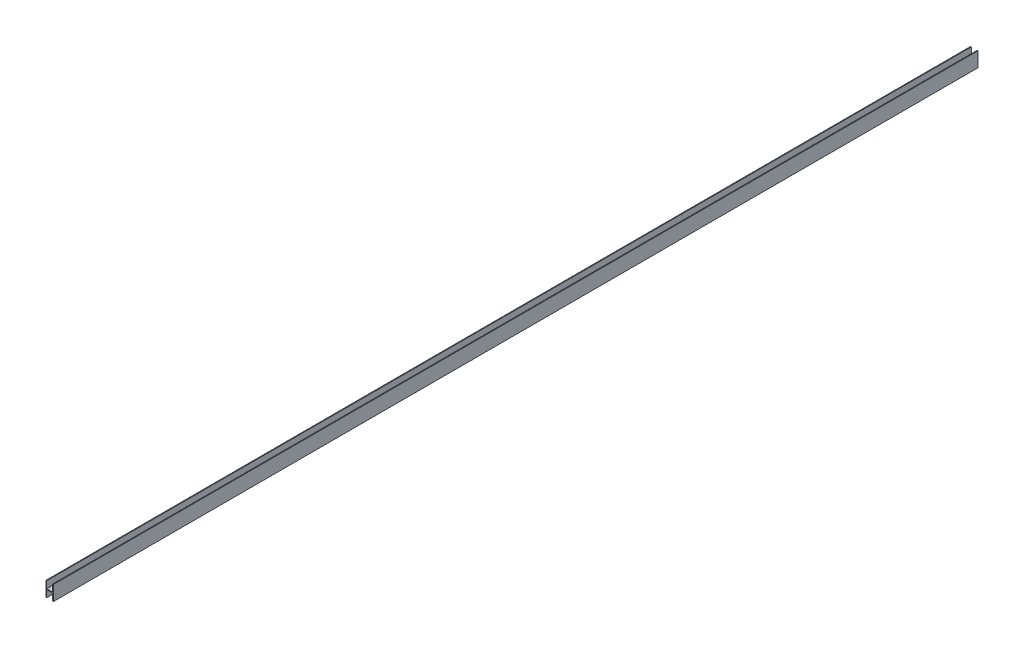
ISO-10303-21;
HEADER;
FILE_DESCRIPTION(('STEP AP214'),'2;1');
FILE_NAME('part.step','',(''),(''),'','','');
FILE_SCHEMA(('AUTOMOTIVE_DESIGN { 1 0 10303 214 1 1 1 1 }'));
ENDSEC;
DATA;
#1=APPLICATION_CONTEXT('core data for automotive mechanical design processes');
#2=APPLICATION_PROTOCOL_DEFINITION('international standard','automotive_design',2000,#1);
#3=PRODUCT_CONTEXT('',#1,'mechanical');
#4=PRODUCT('Part','Part','',(#3));
#5=PRODUCT_RELATED_PRODUCT_CATEGORY('part','',(#4));
#6=PRODUCT_DEFINITION_FORMATION('','',#4);
#7=PRODUCT_DEFINITION_CONTEXT('part definition',#1,'design');
#8=PRODUCT_DEFINITION('design','',#6,#7);
#9=PRODUCT_DEFINITION_SHAPE('','',#8);
#10=(LENGTH_UNIT() NAMED_UNIT(*) SI_UNIT(.MILLI.,.METRE.));
#11=(NAMED_UNIT(*) PLANE_ANGLE_UNIT() SI_UNIT($,.RADIAN.));
#12=(NAMED_UNIT(*) SI_UNIT($,.STERADIAN.) SOLID_ANGLE_UNIT());
#13=UNCERTAINTY_MEASURE_WITH_UNIT(LENGTH_MEASURE(1.E-05),#10,'distance_accuracy_value','');
#14=(GEOMETRIC_REPRESENTATION_CONTEXT(3) GLOBAL_UNCERTAINTY_ASSIGNED_CONTEXT((#13)) GLOBAL_UNIT_ASSIGNED_CONTEXT((#10,
#11,#12)) REPRESENTATION_CONTEXT('',''));
#15=CARTESIAN_POINT('',(0.,0.,0.));
#16=DIRECTION('',(0.,0.,1.));
#17=DIRECTION('',(1.,0.,0.));
#18=AXIS2_PLACEMENT_3D('',#15,#16,#17);
#19=CARTESIAN_POINT('',(-5.,10.,1251.));
#20=DIRECTION('',(0.,-1.,0.));
#21=DIRECTION('',(0.,0.,-1.));
#22=AXIS2_PLACEMENT_3D('',#19,#20,#21);
#23=PLANE('',#22);
#24=DIRECTION('',(-1.,0.,0.));
#25=VECTOR('',#24,1.);
#26=CARTESIAN_POINT('',(-5.,10.,1251.));
#27=LINE('',#26,#25);
#28=CARTESIAN_POINT('',(-4.,10.,1251.));
#29=VERTEX_POINT('',#28);
#30=CARTESIAN_POINT('',(-5.,10.,1251.));
#31=VERTEX_POINT('',#30);
#32=EDGE_CURVE('E180',#29,#31,#27,.T.);
#33=ORIENTED_EDGE('',*,*,#32,.F.);
#34=DIRECTION('',(0.,0.,-1.));
#35=VECTOR('',#34,1.);
#36=CARTESIAN_POINT('',(-4.,10.,1251.));
#37=LINE('',#36,#35);
#38=CARTESIAN_POINT('',(-4.,10.,0.));
#39=VERTEX_POINT('',#38);
#40=EDGE_CURVE('E173',#29,#39,#37,.T.);
#41=ORIENTED_EDGE('',*,*,#40,.T.);
#42=DIRECTION('',(-1.,0.,0.));
#43=VECTOR('',#42,1.);
#44=CARTESIAN_POINT('',(-5.,10.,0.));
#45=LINE('',#44,#43);
#46=CARTESIAN_POINT('',(-5.,10.,0.));
#47=VERTEX_POINT('',#46);
#48=EDGE_CURVE('E194',#39,#47,#45,.T.);
#49=ORIENTED_EDGE('',*,*,#48,.T.);
#50=DIRECTION('',(0.,0.,-1.));
#51=VECTOR('',#50,1.);
#52=CARTESIAN_POINT('',(-5.,10.,1251.));
#53=LINE('',#52,#51);
#54=EDGE_CURVE('E207',#31,#47,#53,.T.);
#55=ORIENTED_EDGE('',*,*,#54,.F.);
#56=EDGE_LOOP('',(#33,#41,#49,#55));
#57=FACE_BOUND('',#56,.T.);
#58=ADVANCED_FACE('F33',(#57),#23,.F.);
#59=CARTESIAN_POINT('',(-5.,-10.,1251.));
#60=DIRECTION('',(0.,1.,0.));
#61=DIRECTION('',(0.,0.,1.));
#62=AXIS2_PLACEMENT_3D('',#59,#60,#61);
#63=PLANE('',#62);
#64=DIRECTION('',(1.,0.,0.));
#65=VECTOR('',#64,1.);
#66=CARTESIAN_POINT('',(-5.,-10.,0.));
#67=LINE('',#66,#65);
#68=CARTESIAN_POINT('',(-5.,-10.,0.));
#69=VERTEX_POINT('',#68);
#70=CARTESIAN_POINT('',(-4.,-10.,0.));
#71=VERTEX_POINT('',#70);
#72=EDGE_CURVE('E181',#69,#71,#67,.T.);
#73=ORIENTED_EDGE('',*,*,#72,.T.);
#74=DIRECTION('',(0.,0.,1.));
#75=VECTOR('',#74,1.);
#76=CARTESIAN_POINT('',(-4.,-10.,1251.));
#77=LINE('',#76,#75);
#78=CARTESIAN_POINT('',(-4.,-10.,1251.));
#79=VERTEX_POINT('',#78);
#80=EDGE_CURVE('E163',#71,#79,#77,.T.);
#81=ORIENTED_EDGE('',*,*,#80,.T.);
#82=DIRECTION('',(1.,0.,0.));
#83=VECTOR('',#82,1.);
#84=CARTESIAN_POINT('',(-5.,-10.,1251.));
#85=LINE('',#84,#83);
#86=CARTESIAN_POINT('',(-5.,-10.,1251.));
#87=VERTEX_POINT('',#86);
#88=EDGE_CURVE('E188',#87,#79,#85,.T.);
#89=ORIENTED_EDGE('',*,*,#88,.F.);
#90=DIRECTION('',(0.,0.,-1.));
#91=VECTOR('',#90,1.);
#92=CARTESIAN_POINT('',(-5.,-10.,1251.));
#93=LINE('',#92,#91);
#94=EDGE_CURVE('E204',#87,#69,#93,.T.);
#95=ORIENTED_EDGE('',*,*,#94,.T.);
#96=EDGE_LOOP('',(#73,#81,#89,#95));
#97=FACE_BOUND('',#96,.T.);
#98=ADVANCED_FACE('F227',(#97),#63,.F.);
#99=CARTESIAN_POINT('',(5.,-10.,1251.));
#100=DIRECTION('',(-1.,0.,0.));
#101=DIRECTION('',(0.,0.,1.));
#102=AXIS2_PLACEMENT_3D('',#99,#100,#101);
#103=PLANE('',#102);
#104=DIRECTION('',(0.,1.,0.));
#105=VECTOR('',#104,1.);
#106=CARTESIAN_POINT('',(5.,-10.,0.));
#107=LINE('',#106,#105);
#108=CARTESIAN_POINT('',(5.,-10.,0.));
#109=VERTEX_POINT('',#108);
#110=CARTESIAN_POINT('',(5.,10.,0.));
#111=VERTEX_POINT('',#110);
#112=EDGE_CURVE('E176',#109,#111,#107,.T.);
#113=ORIENTED_EDGE('',*,*,#112,.T.);
#114=DIRECTION('',(0.,0.,-1.));
#115=VECTOR('',#114,1.);
#116=CARTESIAN_POINT('',(5.,10.,1251.));
#117=LINE('',#116,#115);
#118=CARTESIAN_POINT('',(5.,10.,1251.));
#119=VERTEX_POINT('',#118);
#120=EDGE_CURVE('E210',#119,#111,#117,.T.);
#121=ORIENTED_EDGE('',*,*,#120,.F.);
#122=DIRECTION('',(0.,1.,0.));
#123=VECTOR('',#122,1.);
#124=CARTESIAN_POINT('',(5.,-10.,1251.));
#125=LINE('',#124,#123);
#126=CARTESIAN_POINT('',(5.,-10.,1251.));
#127=VERTEX_POINT('',#126);
#128=EDGE_CURVE('E177',#127,#119,#125,.T.);
#129=ORIENTED_EDGE('',*,*,#128,.F.);
#130=DIRECTION('',(0.,0.,-1.));
#131=VECTOR('',#130,1.);
#132=CARTESIAN_POINT('',(5.,-10.,1251.));
#133=LINE('',#132,#131);
#134=EDGE_CURVE('E191',#127,#109,#133,.T.);
#135=ORIENTED_EDGE('',*,*,#134,.T.);
#136=EDGE_LOOP('',(#113,#121,#129,#135));
#137=FACE_BOUND('',#136,.T.);
#138=ADVANCED_FACE('F35',(#137),#103,.F.);
#139=CARTESIAN_POINT('',(4.,10.,0.));
#140=VERTEX_POINT('',#139);
#141=EDGE_CURVE('E195',#111,#140,#45,.T.);
#142=ORIENTED_EDGE('',*,*,#141,.T.);
#143=DIRECTION('',(0.,0.,1.));
#144=VECTOR('',#143,1.);
#145=CARTESIAN_POINT('',(4.,10.,1251.));
#146=LINE('',#145,#144);
#147=CARTESIAN_POINT('',(4.,10.,1251.));
#148=VERTEX_POINT('',#147);
#149=EDGE_CURVE('E55',#140,#148,#146,.T.);
#150=ORIENTED_EDGE('',*,*,#149,.T.);
#151=EDGE_CURVE('E182',#119,#148,#27,.T.);
#152=ORIENTED_EDGE('',*,*,#151,.F.);
#153=ORIENTED_EDGE('',*,*,#120,.T.);
#154=EDGE_LOOP('',(#142,#150,#152,#153));
#155=FACE_BOUND('',#154,.T.);
#156=ADVANCED_FACE('F239',(#155),#23,.F.);
#157=CARTESIAN_POINT('',(-5.,-10.,1251.));
#158=DIRECTION('',(1.,0.,0.));
#159=DIRECTION('',(0.,0.,-1.));
#160=AXIS2_PLACEMENT_3D('',#157,#158,#159);
#161=PLANE('',#160);
#162=DIRECTION('',(0.,-1.,0.));
#163=VECTOR('',#162,1.);
#164=CARTESIAN_POINT('',(-5.,-10.,0.));
#165=LINE('',#164,#163);
#166=EDGE_CURVE('E197',#47,#69,#165,.T.);
#167=ORIENTED_EDGE('',*,*,#166,.T.);
#168=ORIENTED_EDGE('',*,*,#94,.F.);
#169=DIRECTION('',(0.,-1.,0.));
#170=VECTOR('',#169,1.);
#171=CARTESIAN_POINT('',(-5.,-10.,1251.));
#172=LINE('',#171,#170);
#173=EDGE_CURVE('E185',#31,#87,#172,.T.);
#174=ORIENTED_EDGE('',*,*,#173,.F.);
#175=ORIENTED_EDGE('',*,*,#54,.T.);
#176=EDGE_LOOP('',(#167,#168,#174,#175));
#177=FACE_BOUND('',#176,.T.);
#178=ADVANCED_FACE('F231',(#177),#161,.F.);
#179=CARTESIAN_POINT('',(4.,-10.,1251.));
#180=VERTEX_POINT('',#179);
#181=EDGE_CURVE('E187',#180,#127,#85,.T.);
#182=ORIENTED_EDGE('',*,*,#181,.F.);
#183=DIRECTION('',(0.,0.,-1.));
#184=VECTOR('',#183,1.);
#185=CARTESIAN_POINT('',(4.,-10.,1251.));
#186=LINE('',#185,#184);
#187=CARTESIAN_POINT('',(4.,-10.,0.));
#188=VERTEX_POINT('',#187);
#189=EDGE_CURVE('E157',#180,#188,#186,.T.);
#190=ORIENTED_EDGE('',*,*,#189,.T.);
#191=EDGE_CURVE('E199',#188,#109,#67,.T.);
#192=ORIENTED_EDGE('',*,*,#191,.T.);
#193=ORIENTED_EDGE('',*,*,#134,.F.);
#194=EDGE_LOOP('',(#182,#190,#192,#193));
#195=FACE_BOUND('',#194,.T.);
#196=ADVANCED_FACE('F246',(#195),#63,.F.);
#197=CARTESIAN_POINT('',(0.,0.,1251.));
#198=DIRECTION('',(0.,0.,-1.));
#199=DIRECTION('',(-1.,0.,0.));
#200=AXIS2_PLACEMENT_3D('',#197,#198,#199);
#201=PLANE('',#200);
#202=DIRECTION('',(-1.,0.,0.));
#203=VECTOR('',#202,1.);
#204=CARTESIAN_POINT('',(0.,0.5,1251.));
#205=LINE('',#204,#203);
#206=CARTESIAN_POINT('',(4.,0.5,1251.));
#207=VERTEX_POINT('',#206);
#208=CARTESIAN_POINT('',(-4.,0.5,1251.));
#209=VERTEX_POINT('',#208);
#210=EDGE_CURVE('E130',#207,#209,#205,.T.);
#211=ORIENTED_EDGE('',*,*,#210,.T.);
#212=DIRECTION('',(0.,1.,0.));
#213=VECTOR('',#212,1.);
#214=CARTESIAN_POINT('',(-4.,0.,1251.));
#215=LINE('',#214,#213);
#216=EDGE_CURVE('E170',#209,#29,#215,.T.);
#217=ORIENTED_EDGE('',*,*,#216,.T.);
#218=ORIENTED_EDGE('',*,*,#32,.T.);
#219=ORIENTED_EDGE('',*,*,#173,.T.);
#220=ORIENTED_EDGE('',*,*,#88,.T.);
#221=DIRECTION('',(0.,1.,0.));
#222=VECTOR('',#221,1.);
#223=CARTESIAN_POINT('',(-4.,0.,1251.));
#224=LINE('',#223,#222);
#225=CARTESIAN_POINT('',(-4.,-0.5,1251.));
#226=VERTEX_POINT('',#225);
#227=EDGE_CURVE('E160',#79,#226,#224,.T.);
#228=ORIENTED_EDGE('',*,*,#227,.T.);
#229=DIRECTION('',(1.,0.,0.));
#230=VECTOR('',#229,1.);
#231=CARTESIAN_POINT('',(0.,-0.5,1251.));
#232=LINE('',#231,#230);
#233=CARTESIAN_POINT('',(4.,-0.5,1251.));
#234=VERTEX_POINT('',#233);
#235=EDGE_CURVE('E144',#226,#234,#232,.T.);
#236=ORIENTED_EDGE('',*,*,#235,.T.);
#237=DIRECTION('',(0.,-1.,0.));
#238=VECTOR('',#237,1.);
#239=CARTESIAN_POINT('',(4.,0.,1251.));
#240=LINE('',#239,#238);
#241=EDGE_CURVE('E154',#234,#180,#240,.T.);
#242=ORIENTED_EDGE('',*,*,#241,.T.);
#243=ORIENTED_EDGE('',*,*,#181,.T.);
#244=ORIENTED_EDGE('',*,*,#128,.T.);
#245=ORIENTED_EDGE('',*,*,#151,.T.);
#246=DIRECTION('',(0.,-1.,0.));
#247=VECTOR('',#246,1.);
#248=CARTESIAN_POINT('',(4.,0.,1251.));
#249=LINE('',#248,#247);
#250=EDGE_CURVE('E166',#148,#207,#249,.T.);
#251=ORIENTED_EDGE('',*,*,#250,.T.);
#252=EDGE_LOOP('',(#211,#217,#218,#219,#220,#228,#236,#242,#243,#244,#245,#251));
#253=FACE_BOUND('',#252,.T.);
#254=ADVANCED_FACE('F223',(#253),#201,.F.);
#255=CARTESIAN_POINT('',(0.,0.,0.));
#256=DIRECTION('',(0.,0.,-1.));
#257=DIRECTION('',(-1.,0.,0.));
#258=AXIS2_PLACEMENT_3D('',#255,#256,#257);
#259=PLANE('',#258);
#260=DIRECTION('',(0.,1.,0.));
#261=VECTOR('',#260,1.);
#262=CARTESIAN_POINT('',(-4.,19.5,0.));
#263=LINE('',#262,#261);
#264=CARTESIAN_POINT('',(-4.,0.5,0.));
#265=VERTEX_POINT('',#264);
#266=EDGE_CURVE('E139',#265,#39,#263,.T.);
#267=ORIENTED_EDGE('',*,*,#266,.F.);
#268=DIRECTION('',(-1.,0.,0.));
#269=VECTOR('',#268,1.);
#270=CARTESIAN_POINT('',(4.,0.5,0.));
#271=LINE('',#270,#269);
#272=CARTESIAN_POINT('',(4.,0.5,0.));
#273=VERTEX_POINT('',#272);
#274=EDGE_CURVE('E127',#273,#265,#271,.T.);
#275=ORIENTED_EDGE('',*,*,#274,.F.);
#276=DIRECTION('',(0.,-1.,0.));
#277=VECTOR('',#276,1.);
#278=CARTESIAN_POINT('',(4.,0.,0.));
#279=LINE('',#278,#277);
#280=EDGE_CURVE('E11',#140,#273,#279,.T.);
#281=ORIENTED_EDGE('',*,*,#280,.F.);
#282=ORIENTED_EDGE('',*,*,#141,.F.);
#283=ORIENTED_EDGE('',*,*,#112,.F.);
#284=ORIENTED_EDGE('',*,*,#191,.F.);
#285=DIRECTION('',(0.,-1.,0.));
#286=VECTOR('',#285,1.);
#287=CARTESIAN_POINT('',(4.,-0.5,0.));
#288=LINE('',#287,#286);
#289=CARTESIAN_POINT('',(4.,-0.5,0.));
#290=VERTEX_POINT('',#289);
#291=EDGE_CURVE('E148',#290,#188,#288,.T.);
#292=ORIENTED_EDGE('',*,*,#291,.F.);
#293=DIRECTION('',(1.,0.,0.));
#294=VECTOR('',#293,1.);
#295=CARTESIAN_POINT('',(4.,-0.5,0.));
#296=LINE('',#295,#294);
#297=CARTESIAN_POINT('',(-4.,-0.5,0.));
#298=VERTEX_POINT('',#297);
#299=EDGE_CURVE('E146',#298,#290,#296,.T.);
#300=ORIENTED_EDGE('',*,*,#299,.F.);
#301=DIRECTION('',(0.,1.,0.));
#302=VECTOR('',#301,1.);
#303=CARTESIAN_POINT('',(-4.,0.,0.));
#304=LINE('',#303,#302);
#305=EDGE_CURVE('E41',#71,#298,#304,.T.);
#306=ORIENTED_EDGE('',*,*,#305,.F.);
#307=ORIENTED_EDGE('',*,*,#72,.F.);
#308=ORIENTED_EDGE('',*,*,#166,.F.);
#309=ORIENTED_EDGE('',*,*,#48,.F.);
#310=EDGE_LOOP('',(#267,#275,#281,#282,#283,#284,#292,#300,#306,#307,#308,#309));
#311=FACE_BOUND('',#310,.T.);
#312=ADVANCED_FACE('F137',(#311),#259,.T.);
#313=CARTESIAN_POINT('',(-4.,-0.5,2503.));
#314=DIRECTION('',(-1.,0.,0.));
#315=DIRECTION('',(0.,0.,1.));
#316=AXIS2_PLACEMENT_3D('',#313,#314,#315);
#317=PLANE('',#316);
#318=ORIENTED_EDGE('',*,*,#305,.T.);
#319=DIRECTION('',(0.,0.,-1.));
#320=VECTOR('',#319,1.);
#321=CARTESIAN_POINT('',(-4.,-0.5,2503.));
#322=LINE('',#321,#320);
#323=EDGE_CURVE('E48',#226,#298,#322,.T.);
#324=ORIENTED_EDGE('',*,*,#323,.F.);
#325=ORIENTED_EDGE('',*,*,#227,.F.);
#326=ORIENTED_EDGE('',*,*,#80,.F.);
#327=EDGE_LOOP('',(#318,#324,#325,#326));
#328=FACE_BOUND('',#327,.T.);
#329=ADVANCED_FACE('F215',(#328),#317,.F.);
#330=CARTESIAN_POINT('',(4.,-0.5,2503.));
#331=DIRECTION('',(1.,0.,0.));
#332=DIRECTION('',(0.,0.,-1.));
#333=AXIS2_PLACEMENT_3D('',#330,#331,#332);
#334=PLANE('',#333);
#335=ORIENTED_EDGE('',*,*,#241,.F.);
#336=DIRECTION('',(0.,0.,-1.));
#337=VECTOR('',#336,1.);
#338=CARTESIAN_POINT('',(4.,-0.5,2503.));
#339=LINE('',#338,#337);
#340=EDGE_CURVE('E141',#234,#290,#339,.T.);
#341=ORIENTED_EDGE('',*,*,#340,.T.);
#342=ORIENTED_EDGE('',*,*,#291,.T.);
#343=ORIENTED_EDGE('',*,*,#189,.F.);
#344=EDGE_LOOP('',(#335,#341,#342,#343));
#345=FACE_BOUND('',#344,.T.);
#346=ADVANCED_FACE('F247',(#345),#334,.F.);
#347=CARTESIAN_POINT('',(4.,-0.5,2503.));
#348=DIRECTION('',(0.,1.,0.));
#349=DIRECTION('',(-1.,0.,0.));
#350=AXIS2_PLACEMENT_3D('',#347,#348,#349);
#351=PLANE('',#350);
#352=ORIENTED_EDGE('',*,*,#323,.T.);
#353=ORIENTED_EDGE('',*,*,#299,.T.);
#354=ORIENTED_EDGE('',*,*,#340,.F.);
#355=ORIENTED_EDGE('',*,*,#235,.F.);
#356=EDGE_LOOP('',(#352,#353,#354,#355));
#357=FACE_BOUND('',#356,.T.);
#358=ADVANCED_FACE('F220',(#357),#351,.F.);
#359=CARTESIAN_POINT('',(-4.,19.5,2503.));
#360=DIRECTION('',(-1.,0.,0.));
#361=DIRECTION('',(0.,0.,1.));
#362=AXIS2_PLACEMENT_3D('',#359,#360,#361);
#363=PLANE('',#362);
#364=ORIENTED_EDGE('',*,*,#216,.F.);
#365=DIRECTION('',(0.,0.,-1.));
#366=VECTOR('',#365,1.);
#367=CARTESIAN_POINT('',(-4.,0.5,2503.));
#368=LINE('',#367,#366);
#369=EDGE_CURVE('E132',#209,#265,#368,.T.);
#370=ORIENTED_EDGE('',*,*,#369,.T.);
#371=ORIENTED_EDGE('',*,*,#266,.T.);
#372=ORIENTED_EDGE('',*,*,#40,.F.);
#373=EDGE_LOOP('',(#364,#370,#371,#372));
#374=FACE_BOUND('',#373,.T.);
#375=ADVANCED_FACE('F237',(#374),#363,.F.);
#376=CARTESIAN_POINT('',(4.,0.5,2503.));
#377=DIRECTION('',(0.,-1.,0.));
#378=DIRECTION('',(1.,0.,0.));
#379=AXIS2_PLACEMENT_3D('',#376,#377,#378);
#380=PLANE('',#379);
#381=DIRECTION('',(0.,0.,-1.));
#382=VECTOR('',#381,1.);
#383=CARTESIAN_POINT('',(4.,0.5,2503.));
#384=LINE('',#383,#382);
#385=EDGE_CURVE('E123',#207,#273,#384,.T.);
#386=ORIENTED_EDGE('',*,*,#385,.T.);
#387=ORIENTED_EDGE('',*,*,#274,.T.);
#388=ORIENTED_EDGE('',*,*,#369,.F.);
#389=ORIENTED_EDGE('',*,*,#210,.F.);
#390=EDGE_LOOP('',(#386,#387,#388,#389));
#391=FACE_BOUND('',#390,.T.);
#392=ADVANCED_FACE('F124',(#391),#380,.F.);
#393=CARTESIAN_POINT('',(4.,19.5,2503.));
#394=DIRECTION('',(1.,0.,0.));
#395=DIRECTION('',(0.,0.,-1.));
#396=AXIS2_PLACEMENT_3D('',#393,#394,#395);
#397=PLANE('',#396);
#398=ORIENTED_EDGE('',*,*,#280,.T.);
#399=ORIENTED_EDGE('',*,*,#385,.F.);
#400=ORIENTED_EDGE('',*,*,#250,.F.);
#401=ORIENTED_EDGE('',*,*,#149,.F.);
#402=EDGE_LOOP('',(#398,#399,#400,#401));
#403=FACE_BOUND('',#402,.T.);
#404=ADVANCED_FACE('F134',(#403),#397,.F.);
#405=CLOSED_SHELL('',(#58,#98,#138,#156,#178,#196,#254,#312,#329,#346,#358,#375,#392,#404));
#406=MANIFOLD_SOLID_BREP('B2',#405);
#407=ADVANCED_BREP_SHAPE_REPRESENTATION('',(#18,#406),#14);
#408=SHAPE_DEFINITION_REPRESENTATION(#9,#407);
ENDSEC;
END-ISO-10303-21;
